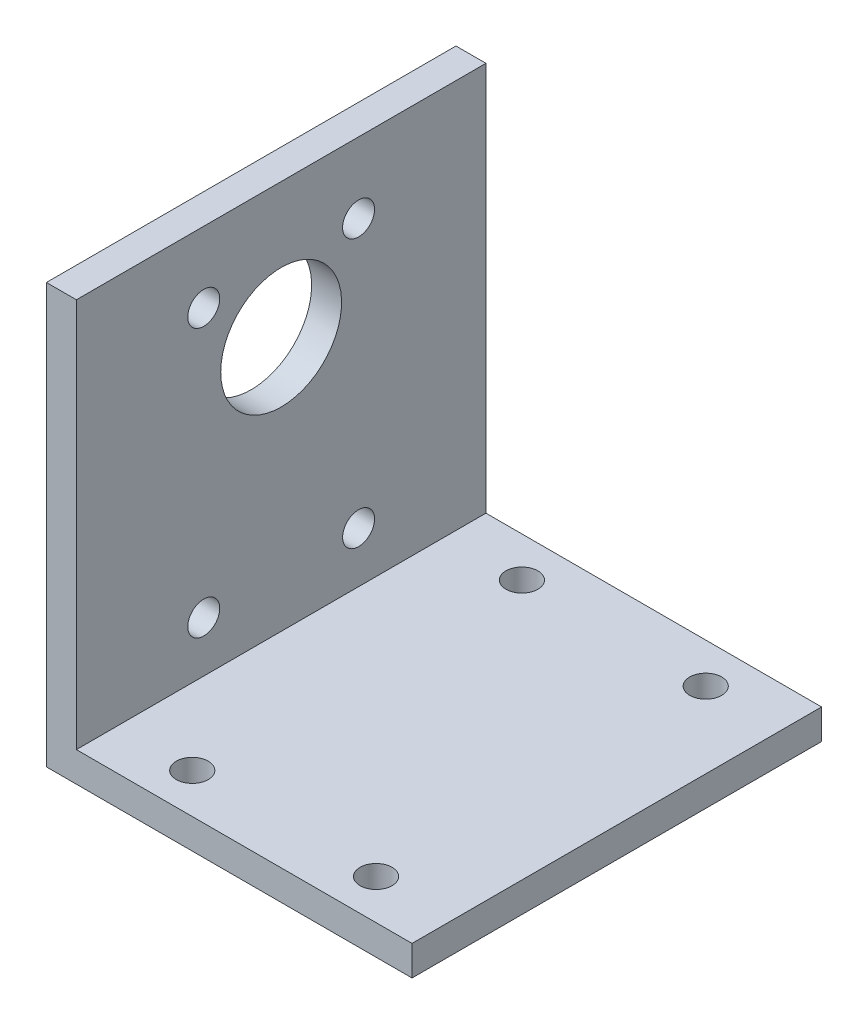
ISO-10303-21;
HEADER;
FILE_DESCRIPTION(('STEP AP214'),'2;1');
FILE_NAME('part.step','',(''),(''),'','','');
FILE_SCHEMA(('AUTOMOTIVE_DESIGN { 1 0 10303 214 1 1 1 1 }'));
ENDSEC;
DATA;
#1=APPLICATION_CONTEXT('core data for automotive mechanical design processes');
#2=APPLICATION_PROTOCOL_DEFINITION('international standard','automotive_design',2000,#1);
#3=PRODUCT_CONTEXT('',#1,'mechanical');
#4=PRODUCT('Part','Part','',(#3));
#5=PRODUCT_RELATED_PRODUCT_CATEGORY('part','',(#4));
#6=PRODUCT_DEFINITION_FORMATION('','',#4);
#7=PRODUCT_DEFINITION_CONTEXT('part definition',#1,'design');
#8=PRODUCT_DEFINITION('design','',#6,#7);
#9=PRODUCT_DEFINITION_SHAPE('','',#8);
#10=(LENGTH_UNIT() NAMED_UNIT(*) SI_UNIT(.MILLI.,.METRE.));
#11=(NAMED_UNIT(*) PLANE_ANGLE_UNIT() SI_UNIT($,.RADIAN.));
#12=(NAMED_UNIT(*) SI_UNIT($,.STERADIAN.) SOLID_ANGLE_UNIT());
#13=UNCERTAINTY_MEASURE_WITH_UNIT(LENGTH_MEASURE(1.E-05),#10,'distance_accuracy_value','');
#14=(GEOMETRIC_REPRESENTATION_CONTEXT(3) GLOBAL_UNCERTAINTY_ASSIGNED_CONTEXT((#13)) GLOBAL_UNIT_ASSIGNED_CONTEXT((#10,
#11,#12)) REPRESENTATION_CONTEXT('',''));
#15=CARTESIAN_POINT('',(0.,0.,0.));
#16=DIRECTION('',(0.,0.,1.));
#17=DIRECTION('',(1.,0.,0.));
#18=AXIS2_PLACEMENT_3D('',#15,#16,#17);
#19=CARTESIAN_POINT('',(36.6,0.,41.));
#20=DIRECTION('',(0.,1.,0.));
#21=DIRECTION('',(0.,0.,1.));
#22=AXIS2_PLACEMENT_3D('',#19,#20,#21);
#23=PLANE('',#22);
#24=CARTESIAN_POINT('',(10.6,0.,4.));
#25=DIRECTION('',(0.,-1.,0.));
#26=DIRECTION('',(0.,0.,-1.));
#27=AXIS2_PLACEMENT_3D('',#24,#25,#26);
#28=CIRCLE('',#27,1.6);
#29=CARTESIAN_POINT('',(10.6,0.,2.4));
#30=VERTEX_POINT('',#29);
#31=EDGE_CURVE('E236',#30,#30,#28,.T.);
#32=ORIENTED_EDGE('',*,*,#31,.F.);
#33=EDGE_LOOP('',(#32));
#34=FACE_BOUND('',#33,.T.);
#35=CARTESIAN_POINT('',(29.,0.,4.));
#36=DIRECTION('',(0.,-1.,0.));
#37=DIRECTION('',(0.,0.,-1.));
#38=AXIS2_PLACEMENT_3D('',#35,#36,#37);
#39=CIRCLE('',#38,1.6);
#40=CARTESIAN_POINT('',(29.,0.,2.4));
#41=VERTEX_POINT('',#40);
#42=EDGE_CURVE('E240',#41,#41,#39,.T.);
#43=ORIENTED_EDGE('',*,*,#42,.F.);
#44=EDGE_LOOP('',(#43));
#45=FACE_BOUND('',#44,.T.);
#46=CARTESIAN_POINT('',(29.,0.,37.));
#47=DIRECTION('',(0.,-1.,0.));
#48=DIRECTION('',(0.,0.,-1.));
#49=AXIS2_PLACEMENT_3D('',#46,#47,#48);
#50=CIRCLE('',#49,1.6);
#51=CARTESIAN_POINT('',(29.,0.,35.4));
#52=VERTEX_POINT('',#51);
#53=EDGE_CURVE('E235',#52,#52,#50,.T.);
#54=ORIENTED_EDGE('',*,*,#53,.F.);
#55=EDGE_LOOP('',(#54));
#56=FACE_BOUND('',#55,.T.);
#57=CARTESIAN_POINT('',(10.6,0.,37.));
#58=DIRECTION('',(0.,-1.,0.));
#59=DIRECTION('',(0.,0.,-1.));
#60=AXIS2_PLACEMENT_3D('',#57,#58,#59);
#61=CIRCLE('',#60,1.6);
#62=CARTESIAN_POINT('',(10.6,0.,35.4));
#63=VERTEX_POINT('',#62);
#64=EDGE_CURVE('E171',#63,#63,#61,.T.);
#65=ORIENTED_EDGE('',*,*,#64,.F.);
#66=EDGE_LOOP('',(#65));
#67=FACE_BOUND('',#66,.T.);
#68=DIRECTION('',(1.,0.,0.));
#69=VECTOR('',#68,1.);
#70=CARTESIAN_POINT('',(36.6,0.,0.));
#71=LINE('',#70,#69);
#72=CARTESIAN_POINT('',(0.,0.,0.));
#73=VERTEX_POINT('',#72);
#74=CARTESIAN_POINT('',(36.6,0.,0.));
#75=VERTEX_POINT('',#74);
#76=EDGE_CURVE('E139',#73,#75,#71,.T.);
#77=ORIENTED_EDGE('',*,*,#76,.T.);
#78=DIRECTION('',(0.,0.,-1.));
#79=VECTOR('',#78,1.);
#80=CARTESIAN_POINT('',(36.6,0.,41.));
#81=LINE('',#80,#79);
#82=CARTESIAN_POINT('',(36.6,0.,41.));
#83=VERTEX_POINT('',#82);
#84=EDGE_CURVE('E12',#83,#75,#81,.T.);
#85=ORIENTED_EDGE('',*,*,#84,.F.);
#86=DIRECTION('',(1.,0.,0.));
#87=VECTOR('',#86,1.);
#88=CARTESIAN_POINT('',(36.6,0.,41.));
#89=LINE('',#88,#87);
#90=CARTESIAN_POINT('',(0.,0.,41.));
#91=VERTEX_POINT('',#90);
#92=EDGE_CURVE('E156',#91,#83,#89,.T.);
#93=ORIENTED_EDGE('',*,*,#92,.F.);
#94=DIRECTION('',(0.,0.,-1.));
#95=VECTOR('',#94,1.);
#96=CARTESIAN_POINT('',(0.,0.,41.));
#97=LINE('',#96,#95);
#98=EDGE_CURVE('E135',#91,#73,#97,.T.);
#99=ORIENTED_EDGE('',*,*,#98,.T.);
#100=EDGE_LOOP('',(#77,#85,#93,#99));
#101=FACE_BOUND('',#100,.T.);
#102=ADVANCED_FACE('F48',(#34,#45,#56,#67,#101),#23,.F.);
#103=CARTESIAN_POINT('',(36.6,3.,41.));
#104=DIRECTION('',(-1.,0.,0.));
#105=DIRECTION('',(0.,0.,1.));
#106=AXIS2_PLACEMENT_3D('',#103,#104,#105);
#107=PLANE('',#106);
#108=DIRECTION('',(0.,1.,0.));
#109=VECTOR('',#108,1.);
#110=CARTESIAN_POINT('',(36.6,3.,0.));
#111=LINE('',#110,#109);
#112=CARTESIAN_POINT('',(36.6,3.,0.));
#113=VERTEX_POINT('',#112);
#114=EDGE_CURVE('E143',#75,#113,#111,.T.);
#115=ORIENTED_EDGE('',*,*,#114,.T.);
#116=DIRECTION('',(0.,0.,-1.));
#117=VECTOR('',#116,1.);
#118=CARTESIAN_POINT('',(36.6,3.,41.));
#119=LINE('',#118,#117);
#120=CARTESIAN_POINT('',(36.6,3.,41.));
#121=VERTEX_POINT('',#120);
#122=EDGE_CURVE('E58',#121,#113,#119,.T.);
#123=ORIENTED_EDGE('',*,*,#122,.F.);
#124=DIRECTION('',(0.,1.,0.));
#125=VECTOR('',#124,1.);
#126=CARTESIAN_POINT('',(36.6,3.,41.));
#127=LINE('',#126,#125);
#128=EDGE_CURVE('E104',#83,#121,#127,.T.);
#129=ORIENTED_EDGE('',*,*,#128,.F.);
#130=ORIENTED_EDGE('',*,*,#84,.T.);
#131=EDGE_LOOP('',(#115,#123,#129,#130));
#132=FACE_BOUND('',#131,.T.);
#133=ADVANCED_FACE('F253',(#132),#107,.F.);
#134=CARTESIAN_POINT('',(3.,3.,41.));
#135=DIRECTION('',(0.,-1.,0.));
#136=DIRECTION('',(0.,0.,-1.));
#137=AXIS2_PLACEMENT_3D('',#134,#135,#136);
#138=PLANE('',#137);
#139=CARTESIAN_POINT('',(10.6,3.,4.));
#140=DIRECTION('',(0.,-1.,0.));
#141=DIRECTION('',(0.,0.,-1.));
#142=AXIS2_PLACEMENT_3D('',#139,#140,#141);
#143=CIRCLE('',#142,1.6);
#144=CARTESIAN_POINT('',(10.6,3.,2.4));
#145=VERTEX_POINT('',#144);
#146=EDGE_CURVE('E51',#145,#145,#143,.T.);
#147=ORIENTED_EDGE('',*,*,#146,.T.);
#148=EDGE_LOOP('',(#147));
#149=FACE_BOUND('',#148,.T.);
#150=CARTESIAN_POINT('',(29.,3.,4.));
#151=DIRECTION('',(0.,-1.,0.));
#152=DIRECTION('',(0.,0.,-1.));
#153=AXIS2_PLACEMENT_3D('',#150,#151,#152);
#154=CIRCLE('',#153,1.6);
#155=CARTESIAN_POINT('',(29.,3.,2.4));
#156=VERTEX_POINT('',#155);
#157=EDGE_CURVE('E174',#156,#156,#154,.T.);
#158=ORIENTED_EDGE('',*,*,#157,.T.);
#159=EDGE_LOOP('',(#158));
#160=FACE_BOUND('',#159,.T.);
#161=CARTESIAN_POINT('',(29.,3.,37.));
#162=DIRECTION('',(0.,-1.,0.));
#163=DIRECTION('',(0.,0.,-1.));
#164=AXIS2_PLACEMENT_3D('',#161,#162,#163);
#165=CIRCLE('',#164,1.6);
#166=CARTESIAN_POINT('',(29.,3.,35.4));
#167=VERTEX_POINT('',#166);
#168=EDGE_CURVE('E170',#167,#167,#165,.T.);
#169=ORIENTED_EDGE('',*,*,#168,.T.);
#170=EDGE_LOOP('',(#169));
#171=FACE_BOUND('',#170,.T.);
#172=CARTESIAN_POINT('',(10.6,3.,37.));
#173=DIRECTION('',(0.,-1.,0.));
#174=DIRECTION('',(0.,0.,-1.));
#175=AXIS2_PLACEMENT_3D('',#172,#173,#174);
#176=CIRCLE('',#175,1.6);
#177=CARTESIAN_POINT('',(10.6,3.,35.4));
#178=VERTEX_POINT('',#177);
#179=EDGE_CURVE('E166',#178,#178,#176,.T.);
#180=ORIENTED_EDGE('',*,*,#179,.T.);
#181=EDGE_LOOP('',(#180));
#182=FACE_BOUND('',#181,.T.);
#183=DIRECTION('',(-1.,0.,0.));
#184=VECTOR('',#183,1.);
#185=CARTESIAN_POINT('',(3.,3.,0.));
#186=LINE('',#185,#184);
#187=CARTESIAN_POINT('',(3.,3.,0.));
#188=VERTEX_POINT('',#187);
#189=EDGE_CURVE('E147',#113,#188,#186,.T.);
#190=ORIENTED_EDGE('',*,*,#189,.T.);
#191=DIRECTION('',(0.,0.,-1.));
#192=VECTOR('',#191,1.);
#193=CARTESIAN_POINT('',(3.,3.,41.));
#194=LINE('',#193,#192);
#195=CARTESIAN_POINT('',(3.,3.,41.));
#196=VERTEX_POINT('',#195);
#197=EDGE_CURVE('E128',#196,#188,#194,.T.);
#198=ORIENTED_EDGE('',*,*,#197,.F.);
#199=DIRECTION('',(-1.,0.,0.));
#200=VECTOR('',#199,1.);
#201=CARTESIAN_POINT('',(3.,3.,41.));
#202=LINE('',#201,#200);
#203=EDGE_CURVE('E117',#121,#196,#202,.T.);
#204=ORIENTED_EDGE('',*,*,#203,.F.);
#205=ORIENTED_EDGE('',*,*,#122,.T.);
#206=EDGE_LOOP('',(#190,#198,#204,#205));
#207=FACE_BOUND('',#206,.T.);
#208=ADVANCED_FACE('F264',(#149,#160,#171,#182,#207),#138,.F.);
#209=CARTESIAN_POINT('',(3.,42.,41.));
#210=DIRECTION('',(-1.,0.,0.));
#211=DIRECTION('',(0.,-1.,0.));
#212=AXIS2_PLACEMENT_3D('',#209,#210,#211);
#213=PLANE('',#212);
#214=CARTESIAN_POINT('',(3.00000000000001,8.075,12.75));
#215=DIRECTION('',(-1.,0.,0.));
#216=DIRECTION('',(0.,-1.,0.));
#217=AXIS2_PLACEMENT_3D('',#214,#215,#216);
#218=CIRCLE('',#217,1.6);
#219=CARTESIAN_POINT('',(3.00000000000001,6.475,12.75));
#220=VERTEX_POINT('',#219);
#221=EDGE_CURVE('E144',#220,#220,#218,.T.);
#222=ORIENTED_EDGE('',*,*,#221,.T.);
#223=EDGE_LOOP('',(#222));
#224=FACE_BOUND('',#223,.T.);
#225=CARTESIAN_POINT('',(3.00000000000001,8.07499999999983,28.25));
#226=DIRECTION('',(-1.,0.,0.));
#227=DIRECTION('',(0.,-1.,0.));
#228=AXIS2_PLACEMENT_3D('',#225,#226,#227);
#229=CIRCLE('',#228,1.6);
#230=CARTESIAN_POINT('',(3.00000000000001,6.47499999999983,28.25));
#231=VERTEX_POINT('',#230);
#232=EDGE_CURVE('E213',#231,#231,#229,.T.);
#233=ORIENTED_EDGE('',*,*,#232,.T.);
#234=EDGE_LOOP('',(#233));
#235=FACE_BOUND('',#234,.T.);
#236=CARTESIAN_POINT('',(3.,34.925,28.25));
#237=DIRECTION('',(-1.,0.,0.));
#238=DIRECTION('',(0.,-1.,0.));
#239=AXIS2_PLACEMENT_3D('',#236,#237,#238);
#240=CIRCLE('',#239,1.6);
#241=CARTESIAN_POINT('',(3.,33.325,28.25));
#242=VERTEX_POINT('',#241);
#243=EDGE_CURVE('E209',#242,#242,#240,.T.);
#244=ORIENTED_EDGE('',*,*,#243,.T.);
#245=EDGE_LOOP('',(#244));
#246=FACE_BOUND('',#245,.T.);
#247=CARTESIAN_POINT('',(3.,28.5,20.5));
#248=DIRECTION('',(-1.,0.,0.));
#249=DIRECTION('',(0.,-1.,0.));
#250=AXIS2_PLACEMENT_3D('',#247,#248,#249);
#251=CIRCLE('',#250,6.05);
#252=CARTESIAN_POINT('',(3.,22.45,20.5));
#253=VERTEX_POINT('',#252);
#254=EDGE_CURVE('E205',#253,#253,#251,.T.);
#255=ORIENTED_EDGE('',*,*,#254,.T.);
#256=EDGE_LOOP('',(#255));
#257=FACE_BOUND('',#256,.T.);
#258=CARTESIAN_POINT('',(3.,34.925,12.75));
#259=DIRECTION('',(-1.,0.,0.));
#260=DIRECTION('',(0.,-1.,0.));
#261=AXIS2_PLACEMENT_3D('',#258,#259,#260);
#262=CIRCLE('',#261,1.6);
#263=CARTESIAN_POINT('',(3.,33.325,12.75));
#264=VERTEX_POINT('',#263);
#265=EDGE_CURVE('E200',#264,#264,#262,.T.);
#266=ORIENTED_EDGE('',*,*,#265,.T.);
#267=EDGE_LOOP('',(#266));
#268=FACE_BOUND('',#267,.T.);
#269=DIRECTION('',(0.,1.,0.));
#270=VECTOR('',#269,1.);
#271=CARTESIAN_POINT('',(3.,42.,0.));
#272=LINE('',#271,#270);
#273=CARTESIAN_POINT('',(3.,42.,0.));
#274=VERTEX_POINT('',#273);
#275=EDGE_CURVE('E126',#188,#274,#272,.T.);
#276=ORIENTED_EDGE('',*,*,#275,.T.);
#277=DIRECTION('',(0.,0.,-1.));
#278=VECTOR('',#277,1.);
#279=CARTESIAN_POINT('',(3.,42.,41.));
#280=LINE('',#279,#278);
#281=CARTESIAN_POINT('',(3.,42.,41.));
#282=VERTEX_POINT('',#281);
#283=EDGE_CURVE('E123',#282,#274,#280,.T.);
#284=ORIENTED_EDGE('',*,*,#283,.F.);
#285=DIRECTION('',(0.,1.,0.));
#286=VECTOR('',#285,1.);
#287=CARTESIAN_POINT('',(3.,42.,41.));
#288=LINE('',#287,#286);
#289=EDGE_CURVE('E111',#196,#282,#288,.T.);
#290=ORIENTED_EDGE('',*,*,#289,.F.);
#291=ORIENTED_EDGE('',*,*,#197,.T.);
#292=EDGE_LOOP('',(#276,#284,#290,#291));
#293=FACE_BOUND('',#292,.T.);
#294=ADVANCED_FACE('F124',(#224,#235,#246,#257,#268,#293),#213,.F.);
#295=CARTESIAN_POINT('',(0.,42.,41.));
#296=DIRECTION('',(0.,-1.,0.));
#297=DIRECTION('',(0.,0.,-1.));
#298=AXIS2_PLACEMENT_3D('',#295,#296,#297);
#299=PLANE('',#298);
#300=DIRECTION('',(-1.,0.,0.));
#301=VECTOR('',#300,1.);
#302=CARTESIAN_POINT('',(0.,42.,0.));
#303=LINE('',#302,#301);
#304=CARTESIAN_POINT('',(0.,42.,0.));
#305=VERTEX_POINT('',#304);
#306=EDGE_CURVE('E90',#274,#305,#303,.T.);
#307=ORIENTED_EDGE('',*,*,#306,.T.);
#308=DIRECTION('',(0.,0.,-1.));
#309=VECTOR('',#308,1.);
#310=CARTESIAN_POINT('',(0.,42.,41.));
#311=LINE('',#310,#309);
#312=CARTESIAN_POINT('',(0.,42.,41.));
#313=VERTEX_POINT('',#312);
#314=EDGE_CURVE('E129',#313,#305,#311,.T.);
#315=ORIENTED_EDGE('',*,*,#314,.F.);
#316=DIRECTION('',(-1.,0.,0.));
#317=VECTOR('',#316,1.);
#318=CARTESIAN_POINT('',(0.,42.,41.));
#319=LINE('',#318,#317);
#320=EDGE_CURVE('E115',#282,#313,#319,.T.);
#321=ORIENTED_EDGE('',*,*,#320,.F.);
#322=ORIENTED_EDGE('',*,*,#283,.T.);
#323=EDGE_LOOP('',(#307,#315,#321,#322));
#324=FACE_BOUND('',#323,.T.);
#325=ADVANCED_FACE('F131',(#324),#299,.F.);
#326=CARTESIAN_POINT('',(0.,0.,41.));
#327=DIRECTION('',(1.,0.,0.));
#328=DIRECTION('',(0.,0.,-1.));
#329=AXIS2_PLACEMENT_3D('',#326,#327,#328);
#330=PLANE('',#329);
#331=CARTESIAN_POINT('',(0.,8.075,12.75));
#332=DIRECTION('',(-1.,0.,0.));
#333=DIRECTION('',(0.,0.,1.));
#334=AXIS2_PLACEMENT_3D('',#331,#332,#333);
#335=CIRCLE('',#334,1.6);
#336=CARTESIAN_POINT('',(0.,8.075,14.35));
#337=VERTEX_POINT('',#336);
#338=EDGE_CURVE('E181',#337,#337,#335,.T.);
#339=ORIENTED_EDGE('',*,*,#338,.F.);
#340=EDGE_LOOP('',(#339));
#341=FACE_BOUND('',#340,.T.);
#342=CARTESIAN_POINT('',(0.,8.07499999999983,28.25));
#343=DIRECTION('',(-1.,0.,0.));
#344=DIRECTION('',(0.,0.,1.));
#345=AXIS2_PLACEMENT_3D('',#342,#343,#344);
#346=CIRCLE('',#345,1.6);
#347=CARTESIAN_POINT('',(0.,8.07499999999983,29.85));
#348=VERTEX_POINT('',#347);
#349=EDGE_CURVE('E186',#348,#348,#346,.T.);
#350=ORIENTED_EDGE('',*,*,#349,.F.);
#351=EDGE_LOOP('',(#350));
#352=FACE_BOUND('',#351,.T.);
#353=CARTESIAN_POINT('',(0.,34.925,28.25));
#354=DIRECTION('',(-1.,0.,0.));
#355=DIRECTION('',(0.,0.,1.));
#356=AXIS2_PLACEMENT_3D('',#353,#354,#355);
#357=CIRCLE('',#356,1.6);
#358=CARTESIAN_POINT('',(0.,34.925,29.85));
#359=VERTEX_POINT('',#358);
#360=EDGE_CURVE('E192',#359,#359,#357,.T.);
#361=ORIENTED_EDGE('',*,*,#360,.F.);
#362=EDGE_LOOP('',(#361));
#363=FACE_BOUND('',#362,.T.);
#364=CARTESIAN_POINT('',(0.,28.5,20.5));
#365=DIRECTION('',(-1.,0.,0.));
#366=DIRECTION('',(0.,0.,1.));
#367=AXIS2_PLACEMENT_3D('',#364,#365,#366);
#368=CIRCLE('',#367,6.05);
#369=CARTESIAN_POINT('',(0.,28.5,26.55));
#370=VERTEX_POINT('',#369);
#371=EDGE_CURVE('E201',#370,#370,#368,.T.);
#372=ORIENTED_EDGE('',*,*,#371,.F.);
#373=EDGE_LOOP('',(#372));
#374=FACE_BOUND('',#373,.T.);
#375=CARTESIAN_POINT('',(0.,34.925,12.75));
#376=DIRECTION('',(-1.,0.,0.));
#377=DIRECTION('',(0.,0.,1.));
#378=AXIS2_PLACEMENT_3D('',#375,#376,#377);
#379=CIRCLE('',#378,1.6);
#380=CARTESIAN_POINT('',(0.,34.925,14.35));
#381=VERTEX_POINT('',#380);
#382=EDGE_CURVE('E196',#381,#381,#379,.T.);
#383=ORIENTED_EDGE('',*,*,#382,.F.);
#384=EDGE_LOOP('',(#383));
#385=FACE_BOUND('',#384,.T.);
#386=DIRECTION('',(0.,-1.,0.));
#387=VECTOR('',#386,1.);
#388=CARTESIAN_POINT('',(0.,0.,0.));
#389=LINE('',#388,#387);
#390=EDGE_CURVE('E96',#305,#73,#389,.T.);
#391=ORIENTED_EDGE('',*,*,#390,.T.);
#392=ORIENTED_EDGE('',*,*,#98,.F.);
#393=DIRECTION('',(0.,-1.,0.));
#394=VECTOR('',#393,1.);
#395=CARTESIAN_POINT('',(0.,0.,41.));
#396=LINE('',#395,#394);
#397=EDGE_CURVE('E67',#313,#91,#396,.T.);
#398=ORIENTED_EDGE('',*,*,#397,.F.);
#399=ORIENTED_EDGE('',*,*,#314,.T.);
#400=EDGE_LOOP('',(#391,#392,#398,#399));
#401=FACE_BOUND('',#400,.T.);
#402=ADVANCED_FACE('F275',(#341,#352,#363,#374,#385,#401),#330,.F.);
#403=CARTESIAN_POINT('',(0.,0.,41.));
#404=DIRECTION('',(0.,0.,-1.));
#405=DIRECTION('',(-1.,0.,0.));
#406=AXIS2_PLACEMENT_3D('',#403,#404,#405);
#407=PLANE('',#406);
#408=ORIENTED_EDGE('',*,*,#92,.T.);
#409=ORIENTED_EDGE('',*,*,#128,.T.);
#410=ORIENTED_EDGE('',*,*,#203,.T.);
#411=ORIENTED_EDGE('',*,*,#289,.T.);
#412=ORIENTED_EDGE('',*,*,#320,.T.);
#413=ORIENTED_EDGE('',*,*,#397,.T.);
#414=EDGE_LOOP('',(#408,#409,#410,#411,#412,#413));
#415=FACE_BOUND('',#414,.T.);
#416=ADVANCED_FACE('F113',(#415),#407,.F.);
#417=CARTESIAN_POINT('',(0.,0.,0.));
#418=DIRECTION('',(0.,0.,-1.));
#419=DIRECTION('',(-1.,0.,0.));
#420=AXIS2_PLACEMENT_3D('',#417,#418,#419);
#421=PLANE('',#420);
#422=ORIENTED_EDGE('',*,*,#76,.F.);
#423=ORIENTED_EDGE('',*,*,#390,.F.);
#424=ORIENTED_EDGE('',*,*,#306,.F.);
#425=ORIENTED_EDGE('',*,*,#275,.F.);
#426=ORIENTED_EDGE('',*,*,#189,.F.);
#427=ORIENTED_EDGE('',*,*,#114,.F.);
#428=EDGE_LOOP('',(#422,#423,#424,#425,#426,#427));
#429=FACE_BOUND('',#428,.T.);
#430=ADVANCED_FACE('F261',(#429),#421,.T.);
#431=CARTESIAN_POINT('',(41.,34.925,12.75));
#432=DIRECTION('',(-1.,0.,0.));
#433=DIRECTION('',(0.,0.,1.));
#434=AXIS2_PLACEMENT_3D('',#431,#432,#433);
#435=CYLINDRICAL_SURFACE('',#434,1.6);
#436=ORIENTED_EDGE('',*,*,#382,.T.);
#437=EDGE_LOOP('',(#436));
#438=FACE_BOUND('',#437,.T.);
#439=ORIENTED_EDGE('',*,*,#265,.F.);
#440=EDGE_LOOP('',(#439));
#441=FACE_BOUND('',#440,.T.);
#442=ADVANCED_FACE('F281',(#438,#441),#435,.F.);
#443=CARTESIAN_POINT('',(41.,28.5,20.5));
#444=DIRECTION('',(-1.,0.,0.));
#445=DIRECTION('',(0.,0.,1.));
#446=AXIS2_PLACEMENT_3D('',#443,#444,#445);
#447=CYLINDRICAL_SURFACE('',#446,6.05);
#448=ORIENTED_EDGE('',*,*,#371,.T.);
#449=EDGE_LOOP('',(#448));
#450=FACE_BOUND('',#449,.T.);
#451=ORIENTED_EDGE('',*,*,#254,.F.);
#452=EDGE_LOOP('',(#451));
#453=FACE_BOUND('',#452,.T.);
#454=ADVANCED_FACE('F286',(#450,#453),#447,.F.);
#455=CARTESIAN_POINT('',(41.,34.925,28.25));
#456=DIRECTION('',(-1.,0.,0.));
#457=DIRECTION('',(0.,0.,1.));
#458=AXIS2_PLACEMENT_3D('',#455,#456,#457);
#459=CYLINDRICAL_SURFACE('',#458,1.6);
#460=ORIENTED_EDGE('',*,*,#360,.T.);
#461=EDGE_LOOP('',(#460));
#462=FACE_BOUND('',#461,.T.);
#463=ORIENTED_EDGE('',*,*,#243,.F.);
#464=EDGE_LOOP('',(#463));
#465=FACE_BOUND('',#464,.T.);
#466=ADVANCED_FACE('F295',(#462,#465),#459,.F.);
#467=CARTESIAN_POINT('',(41.,8.07499999999983,28.25));
#468=DIRECTION('',(-1.,0.,0.));
#469=DIRECTION('',(0.,0.,1.));
#470=AXIS2_PLACEMENT_3D('',#467,#468,#469);
#471=CYLINDRICAL_SURFACE('',#470,1.6);
#472=ORIENTED_EDGE('',*,*,#349,.T.);
#473=EDGE_LOOP('',(#472));
#474=FACE_BOUND('',#473,.T.);
#475=ORIENTED_EDGE('',*,*,#232,.F.);
#476=EDGE_LOOP('',(#475));
#477=FACE_BOUND('',#476,.T.);
#478=ADVANCED_FACE('F292',(#474,#477),#471,.F.);
#479=CARTESIAN_POINT('',(41.,8.075,12.75));
#480=DIRECTION('',(-1.,0.,0.));
#481=DIRECTION('',(0.,0.,1.));
#482=AXIS2_PLACEMENT_3D('',#479,#480,#481);
#483=CYLINDRICAL_SURFACE('',#482,1.6);
#484=ORIENTED_EDGE('',*,*,#338,.T.);
#485=EDGE_LOOP('',(#484));
#486=FACE_BOUND('',#485,.T.);
#487=ORIENTED_EDGE('',*,*,#221,.F.);
#488=EDGE_LOOP('',(#487));
#489=FACE_BOUND('',#488,.T.);
#490=ADVANCED_FACE('F288',(#486,#489),#483,.F.);
#491=CARTESIAN_POINT('',(10.6,41.,37.));
#492=DIRECTION('',(0.,-1.,0.));
#493=DIRECTION('',(0.,0.,-1.));
#494=AXIS2_PLACEMENT_3D('',#491,#492,#493);
#495=CYLINDRICAL_SURFACE('',#494,1.6);
#496=ORIENTED_EDGE('',*,*,#64,.T.);
#497=EDGE_LOOP('',(#496));
#498=FACE_BOUND('',#497,.T.);
#499=ORIENTED_EDGE('',*,*,#179,.F.);
#500=EDGE_LOOP('',(#499));
#501=FACE_BOUND('',#500,.T.);
#502=ADVANCED_FACE('F291',(#498,#501),#495,.F.);
#503=CARTESIAN_POINT('',(29.,41.,37.));
#504=DIRECTION('',(0.,-1.,0.));
#505=DIRECTION('',(0.,0.,-1.));
#506=AXIS2_PLACEMENT_3D('',#503,#504,#505);
#507=CYLINDRICAL_SURFACE('',#506,1.6);
#508=ORIENTED_EDGE('',*,*,#53,.T.);
#509=EDGE_LOOP('',(#508));
#510=FACE_BOUND('',#509,.T.);
#511=ORIENTED_EDGE('',*,*,#168,.F.);
#512=EDGE_LOOP('',(#511));
#513=FACE_BOUND('',#512,.T.);
#514=ADVANCED_FACE('F248',(#510,#513),#507,.F.);
#515=CARTESIAN_POINT('',(29.,41.,4.));
#516=DIRECTION('',(0.,-1.,0.));
#517=DIRECTION('',(0.,0.,-1.));
#518=AXIS2_PLACEMENT_3D('',#515,#516,#517);
#519=CYLINDRICAL_SURFACE('',#518,1.6);
#520=ORIENTED_EDGE('',*,*,#42,.T.);
#521=EDGE_LOOP('',(#520));
#522=FACE_BOUND('',#521,.T.);
#523=ORIENTED_EDGE('',*,*,#157,.F.);
#524=EDGE_LOOP('',(#523));
#525=FACE_BOUND('',#524,.T.);
#526=ADVANCED_FACE('F308',(#522,#525),#519,.F.);
#527=CARTESIAN_POINT('',(10.6,41.,4.));
#528=DIRECTION('',(0.,-1.,0.));
#529=DIRECTION('',(0.,0.,-1.));
#530=AXIS2_PLACEMENT_3D('',#527,#528,#529);
#531=CYLINDRICAL_SURFACE('',#530,1.6);
#532=ORIENTED_EDGE('',*,*,#31,.T.);
#533=EDGE_LOOP('',(#532));
#534=FACE_BOUND('',#533,.T.);
#535=ORIENTED_EDGE('',*,*,#146,.F.);
#536=EDGE_LOOP('',(#535));
#537=FACE_BOUND('',#536,.T.);
#538=ADVANCED_FACE('F305',(#534,#537),#531,.F.);
#539=CLOSED_SHELL('',(#102,#133,#208,#294,#325,#402,#416,#430,#442,#454,#466,#478,#490,#502,
#514,#526,#538));
#540=MANIFOLD_SOLID_BREP('B2',#539);
#541=ADVANCED_BREP_SHAPE_REPRESENTATION('',(#18,#540),#14);
#542=SHAPE_DEFINITION_REPRESENTATION(#9,#541);
ENDSEC;
END-ISO-10303-21;
